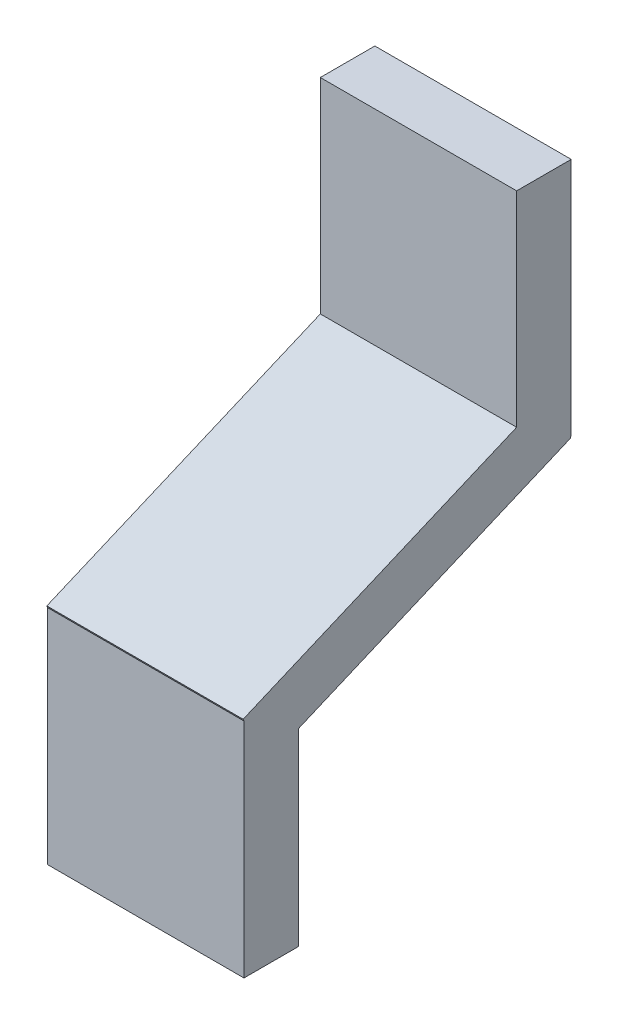
ISO-10303-21;
HEADER;
FILE_DESCRIPTION(('STEP AP214'),'2;1');
FILE_NAME('part.step','',(''),(''),'','','');
FILE_SCHEMA(('AUTOMOTIVE_DESIGN { 1 0 10303 214 1 1 1 1 }'));
ENDSEC;
DATA;
#1=APPLICATION_CONTEXT('core data for automotive mechanical design processes');
#2=APPLICATION_PROTOCOL_DEFINITION('international standard','automotive_design',2000,#1);
#3=PRODUCT_CONTEXT('',#1,'mechanical');
#4=PRODUCT('Part','Part','',(#3));
#5=PRODUCT_RELATED_PRODUCT_CATEGORY('part','',(#4));
#6=PRODUCT_DEFINITION_FORMATION('','',#4);
#7=PRODUCT_DEFINITION_CONTEXT('part definition',#1,'design');
#8=PRODUCT_DEFINITION('design','',#6,#7);
#9=PRODUCT_DEFINITION_SHAPE('','',#8);
#10=(LENGTH_UNIT() NAMED_UNIT(*) SI_UNIT(.MILLI.,.METRE.));
#11=(NAMED_UNIT(*) PLANE_ANGLE_UNIT() SI_UNIT($,.RADIAN.));
#12=(NAMED_UNIT(*) SI_UNIT($,.STERADIAN.) SOLID_ANGLE_UNIT());
#13=UNCERTAINTY_MEASURE_WITH_UNIT(LENGTH_MEASURE(1.E-05),#10,'distance_accuracy_value','');
#14=(GEOMETRIC_REPRESENTATION_CONTEXT(3) GLOBAL_UNCERTAINTY_ASSIGNED_CONTEXT((#13)) GLOBAL_UNIT_ASSIGNED_CONTEXT((#10,
#11,#12)) REPRESENTATION_CONTEXT('',''));
#15=CARTESIAN_POINT('',(0.,0.,0.));
#16=DIRECTION('',(0.,0.,1.));
#17=DIRECTION('',(1.,0.,0.));
#18=AXIS2_PLACEMENT_3D('',#15,#16,#17);
#19=CARTESIAN_POINT('',(5.02,11.,0.5));
#20=DIRECTION('',(0.,0.,1.));
#21=DIRECTION('',(1.,0.,0.));
#22=AXIS2_PLACEMENT_3D('',#19,#20,#21);
#23=PLANE('',#22);
#24=DIRECTION('',(1.,0.,0.));
#25=VECTOR('',#24,1.);
#26=CARTESIAN_POINT('',(5.02,11.3461054439247,0.500000000000314));
#27=LINE('',#26,#25);
#28=CARTESIAN_POINT('',(5.380000014305,11.3461054439242,0.500000000000105));
#29=VERTEX_POINT('',#28);
#30=CARTESIAN_POINT('',(5.02,11.3461054439243,0.500000000000105));
#31=VERTEX_POINT('',#30);
#32=EDGE_CURVE('E148',#29,#31,#27,.F.);
#33=ORIENTED_EDGE('',*,*,#32,.F.);
#34=DIRECTION('',(0.,1.,0.));
#35=VECTOR('',#34,1.);
#36=CARTESIAN_POINT('',(5.380000014305,11.65,0.5));
#37=LINE('',#36,#35);
#38=CARTESIAN_POINT('',(5.380000014305,11.,0.5));
#39=VERTEX_POINT('',#38);
#40=EDGE_CURVE('E154',#39,#29,#37,.T.);
#41=ORIENTED_EDGE('',*,*,#40,.F.);
#42=DIRECTION('',(1.,0.,0.));
#43=VECTOR('',#42,1.);
#44=CARTESIAN_POINT('',(5.02,11.,0.5));
#45=LINE('',#44,#43);
#46=CARTESIAN_POINT('',(5.02,11.,0.5));
#47=VERTEX_POINT('',#46);
#48=EDGE_CURVE('E135',#39,#47,#45,.F.);
#49=ORIENTED_EDGE('',*,*,#48,.T.);
#50=DIRECTION('',(0.,1.,0.));
#51=VECTOR('',#50,1.);
#52=CARTESIAN_POINT('',(5.02,11.65,0.5));
#53=LINE('',#52,#51);
#54=EDGE_CURVE('E182',#47,#31,#53,.T.);
#55=ORIENTED_EDGE('',*,*,#54,.T.);
#56=EDGE_LOOP('',(#33,#41,#49,#55));
#57=FACE_BOUND('',#56,.T.);
#58=ADVANCED_FACE('F17',(#57),#23,.F.);
#59=CARTESIAN_POINT('',(5.02,11.557949520001,0.0009268707435866));
#60=DIRECTION('',(0.,-0.920504786278108,-0.390731286742046));
#61=DIRECTION('',(0.,0.390731286742046,-0.920504786278108));
#62=AXIS2_PLACEMENT_3D('',#59,#60,#61);
#63=PLANE('',#62);
#64=DIRECTION('',(0.,0.39073128674346,-0.920504786277508));
#65=VECTOR('',#64,1.);
#66=CARTESIAN_POINT('',(5.380000014305,11.346105443924,0.5));
#67=LINE('',#66,#65);
#68=CARTESIAN_POINT('',(5.380000014305,11.557949520001,0.000926870743687937));
#69=VERTEX_POINT('',#68);
#70=EDGE_CURVE('E151',#29,#69,#67,.T.);
#71=ORIENTED_EDGE('',*,*,#70,.F.);
#72=ORIENTED_EDGE('',*,*,#32,.T.);
#73=DIRECTION('',(0.,0.39073128674346,-0.920504786277508));
#74=VECTOR('',#73,1.);
#75=CARTESIAN_POINT('',(5.02,11.346105443924,0.5));
#76=LINE('',#75,#74);
#77=CARTESIAN_POINT('',(5.02,11.557949520001,0.000926870743697301));
#78=VERTEX_POINT('',#77);
#79=EDGE_CURVE('E178',#31,#78,#76,.T.);
#80=ORIENTED_EDGE('',*,*,#79,.T.);
#81=DIRECTION('',(1.,0.,0.));
#82=VECTOR('',#81,1.);
#83=CARTESIAN_POINT('',(5.02,11.557949520001,0.00092687074374427));
#84=LINE('',#83,#82);
#85=EDGE_CURVE('E145',#78,#69,#84,.T.);
#86=ORIENTED_EDGE('',*,*,#85,.T.);
#87=EDGE_LOOP('',(#71,#72,#80,#86));
#88=FACE_BOUND('',#87,.T.);
#89=ADVANCED_FACE('F242',(#88),#63,.T.);
#90=CARTESIAN_POINT('',(5.02,11.65,0.04));
#91=DIRECTION('',(0.,-0.390731286742046,0.920504786278108));
#92=DIRECTION('',(0.,-0.920504786278108,-0.390731286742046));
#93=AXIS2_PLACEMENT_3D('',#90,#91,#92);
#94=PLANE('',#93);
#95=DIRECTION('',(0.,0.920504786259214,0.390731286786557));
#96=VECTOR('',#95,1.);
#97=CARTESIAN_POINT('',(5.02,11.557949520001,0.000926870743659899));
#98=LINE('',#97,#96);
#99=CARTESIAN_POINT('',(5.02,11.56,0.001797248280528));
#100=VERTEX_POINT('',#99);
#101=EDGE_CURVE('E123',#78,#100,#98,.T.);
#102=ORIENTED_EDGE('',*,*,#101,.T.);
#103=DIRECTION('',(1.,0.,0.));
#104=VECTOR('',#103,1.);
#105=CARTESIAN_POINT('',(5.02,11.56,0.001797248280528));
#106=LINE('',#105,#104);
#107=CARTESIAN_POINT('',(5.380000014305,11.56,0.001797248280528));
#108=VERTEX_POINT('',#107);
#109=EDGE_CURVE('E97',#100,#108,#106,.T.);
#110=ORIENTED_EDGE('',*,*,#109,.T.);
#111=DIRECTION('',(0.,0.920504786259214,0.390731286786557));
#112=VECTOR('',#111,1.);
#113=CARTESIAN_POINT('',(5.380000014305,11.557949520001,0.000926870743659899));
#114=LINE('',#113,#112);
#115=EDGE_CURVE('E153',#69,#108,#114,.T.);
#116=ORIENTED_EDGE('',*,*,#115,.F.);
#117=ORIENTED_EDGE('',*,*,#85,.F.);
#118=EDGE_LOOP('',(#102,#110,#116,#117));
#119=FACE_BOUND('',#118,.T.);
#120=ADVANCED_FACE('F243',(#119),#94,.F.);
#121=CARTESIAN_POINT('',(5.02,11.56,0.));
#122=DIRECTION('',(0.,1.,0.));
#123=DIRECTION('',(0.,0.,1.));
#124=AXIS2_PLACEMENT_3D('',#121,#122,#123);
#125=PLANE('',#124);
#126=ORIENTED_EDGE('',*,*,#109,.F.);
#127=DIRECTION('',(0.,0.,1.));
#128=VECTOR('',#127,1.);
#129=CARTESIAN_POINT('',(5.02,11.56,0.));
#130=LINE('',#129,#128);
#131=CARTESIAN_POINT('',(5.02,11.56,0.));
#132=VERTEX_POINT('',#131);
#133=EDGE_CURVE('E20',#100,#132,#130,.F.);
#134=ORIENTED_EDGE('',*,*,#133,.T.);
#135=DIRECTION('',(1.,0.,0.));
#136=VECTOR('',#135,1.);
#137=CARTESIAN_POINT('',(5.02,11.56,0.));
#138=LINE('',#137,#136);
#139=CARTESIAN_POINT('',(5.380000014305,11.56,0.));
#140=VERTEX_POINT('',#139);
#141=EDGE_CURVE('E104',#132,#140,#138,.T.);
#142=ORIENTED_EDGE('',*,*,#141,.T.);
#143=DIRECTION('',(0.,0.,-1.));
#144=VECTOR('',#143,1.);
#145=CARTESIAN_POINT('',(5.380000014305,11.56,0.04));
#146=LINE('',#145,#144);
#147=EDGE_CURVE('E194',#108,#140,#146,.T.);
#148=ORIENTED_EDGE('',*,*,#147,.F.);
#149=EDGE_LOOP('',(#126,#134,#142,#148));
#150=FACE_BOUND('',#149,.T.);
#151=ADVANCED_FACE('F122',(#150),#125,.F.);
#152=CARTESIAN_POINT('',(5.02,11.56,0.));
#153=DIRECTION('',(0.,0.,1.));
#154=DIRECTION('',(1.,0.,0.));
#155=AXIS2_PLACEMENT_3D('',#152,#153,#154);
#156=PLANE('',#155);
#157=ORIENTED_EDGE('',*,*,#141,.F.);
#158=DIRECTION('',(0.,1.,0.));
#159=VECTOR('',#158,1.);
#160=CARTESIAN_POINT('',(5.02,11.65,0.));
#161=LINE('',#160,#159);
#162=CARTESIAN_POINT('',(5.02,11.999999997616,0.));
#163=VERTEX_POINT('',#162);
#164=EDGE_CURVE('E108',#132,#163,#161,.T.);
#165=ORIENTED_EDGE('',*,*,#164,.T.);
#166=DIRECTION('',(1.,0.,0.));
#167=VECTOR('',#166,1.);
#168=CARTESIAN_POINT('',(5.02,11.999999997616,0.));
#169=LINE('',#168,#167);
#170=CARTESIAN_POINT('',(5.380000014305,11.999999997616,0.));
#171=VERTEX_POINT('',#170);
#172=EDGE_CURVE('E110',#171,#163,#169,.F.);
#173=ORIENTED_EDGE('',*,*,#172,.F.);
#174=DIRECTION('',(0.,1.,0.));
#175=VECTOR('',#174,1.);
#176=CARTESIAN_POINT('',(5.380000014305,11.65,0.));
#177=LINE('',#176,#175);
#178=EDGE_CURVE('E109',#140,#171,#177,.T.);
#179=ORIENTED_EDGE('',*,*,#178,.F.);
#180=EDGE_LOOP('',(#157,#165,#173,#179));
#181=FACE_BOUND('',#180,.T.);
#182=ADVANCED_FACE('F106',(#181),#156,.F.);
#183=CARTESIAN_POINT('',(5.02,11.999999997616,0.));
#184=DIRECTION('',(0.,1.,0.));
#185=DIRECTION('',(0.,0.,1.));
#186=AXIS2_PLACEMENT_3D('',#183,#184,#185);
#187=PLANE('',#186);
#188=ORIENTED_EDGE('',*,*,#172,.T.);
#189=DIRECTION('',(0.,0.,-1.));
#190=VECTOR('',#189,1.);
#191=CARTESIAN_POINT('',(5.02,11.999999997616,0.04));
#192=LINE('',#191,#190);
#193=CARTESIAN_POINT('',(5.02,11.999999997616,0.10000000149));
#194=VERTEX_POINT('',#193);
#195=EDGE_CURVE('E120',#163,#194,#192,.F.);
#196=ORIENTED_EDGE('',*,*,#195,.T.);
#197=DIRECTION('',(1.,0.,0.));
#198=VECTOR('',#197,1.);
#199=CARTESIAN_POINT('',(5.02,11.999999997616,0.10000000149));
#200=LINE('',#199,#198);
#201=CARTESIAN_POINT('',(5.380000014305,11.999999997616,0.10000000149));
#202=VERTEX_POINT('',#201);
#203=EDGE_CURVE('E181',#202,#194,#200,.F.);
#204=ORIENTED_EDGE('',*,*,#203,.F.);
#205=DIRECTION('',(0.,0.,-1.));
#206=VECTOR('',#205,1.);
#207=CARTESIAN_POINT('',(5.380000014305,11.999999997616,0.04));
#208=LINE('',#207,#206);
#209=EDGE_CURVE('E140',#171,#202,#208,.F.);
#210=ORIENTED_EDGE('',*,*,#209,.F.);
#211=EDGE_LOOP('',(#188,#196,#204,#210));
#212=FACE_BOUND('',#211,.T.);
#213=ADVANCED_FACE('F271',(#212),#187,.T.);
#214=CARTESIAN_POINT('',(5.02,11.,0.60000000149));
#215=DIRECTION('',(0.,0.,1.));
#216=DIRECTION('',(1.,0.,0.));
#217=AXIS2_PLACEMENT_3D('',#214,#215,#216);
#218=PLANE('',#217);
#219=DIRECTION('',(0.,1.,0.));
#220=VECTOR('',#219,1.);
#221=CARTESIAN_POINT('',(5.380000014305,11.65,0.60000000149));
#222=LINE('',#221,#220);
#223=CARTESIAN_POINT('',(5.380000014305,11.408101447657,0.600000001490072));
#224=VERTEX_POINT('',#223);
#225=CARTESIAN_POINT('',(5.380000014305,11.,0.60000000149));
#226=VERTEX_POINT('',#225);
#227=EDGE_CURVE('E168',#224,#226,#222,.F.);
#228=ORIENTED_EDGE('',*,*,#227,.F.);
#229=DIRECTION('',(1.,0.,0.));
#230=VECTOR('',#229,1.);
#231=CARTESIAN_POINT('',(5.02,11.4081014476569,0.600000001490144));
#232=LINE('',#231,#230);
#233=CARTESIAN_POINT('',(5.02,11.408101447657,0.600000001490072));
#234=VERTEX_POINT('',#233);
#235=EDGE_CURVE('E124',#234,#224,#232,.T.);
#236=ORIENTED_EDGE('',*,*,#235,.F.);
#237=DIRECTION('',(0.,1.,0.));
#238=VECTOR('',#237,1.);
#239=CARTESIAN_POINT('',(5.02,11.65,0.60000000149));
#240=LINE('',#239,#238);
#241=CARTESIAN_POINT('',(5.02,11.,0.60000000149));
#242=VERTEX_POINT('',#241);
#243=EDGE_CURVE('E192',#234,#242,#240,.F.);
#244=ORIENTED_EDGE('',*,*,#243,.T.);
#245=DIRECTION('',(1.,0.,0.));
#246=VECTOR('',#245,1.);
#247=CARTESIAN_POINT('',(5.02,11.,0.60000000149));
#248=LINE('',#247,#246);
#249=EDGE_CURVE('E127',#242,#226,#248,.T.);
#250=ORIENTED_EDGE('',*,*,#249,.T.);
#251=EDGE_LOOP('',(#228,#236,#244,#250));
#252=FACE_BOUND('',#251,.T.);
#253=ADVANCED_FACE('F232',(#252),#218,.T.);
#254=CARTESIAN_POINT('',(5.02,11.,0.5));
#255=DIRECTION('',(0.,1.,0.));
#256=DIRECTION('',(0.,0.,1.));
#257=AXIS2_PLACEMENT_3D('',#254,#255,#256);
#258=PLANE('',#257);
#259=DIRECTION('',(0.,0.,-1.));
#260=VECTOR('',#259,1.);
#261=CARTESIAN_POINT('',(5.02,11.,0.04));
#262=LINE('',#261,#260);
#263=EDGE_CURVE('E187',#242,#47,#262,.T.);
#264=ORIENTED_EDGE('',*,*,#263,.T.);
#265=ORIENTED_EDGE('',*,*,#48,.F.);
#266=DIRECTION('',(0.,0.,-1.));
#267=VECTOR('',#266,1.);
#268=CARTESIAN_POINT('',(5.380000014305,11.,0.04));
#269=LINE('',#268,#267);
#270=EDGE_CURVE('E164',#226,#39,#269,.T.);
#271=ORIENTED_EDGE('',*,*,#270,.F.);
#272=ORIENTED_EDGE('',*,*,#249,.F.);
#273=EDGE_LOOP('',(#264,#265,#271,#272));
#274=FACE_BOUND('',#273,.T.);
#275=ADVANCED_FACE('F235',(#274),#258,.F.);
#276=CARTESIAN_POINT('',(5.02,11.411653909498,0.601507932798));
#277=DIRECTION('',(0.,-0.390731286742046,0.920504786278108));
#278=DIRECTION('',(0.,-0.920504786278108,-0.390731286742046));
#279=AXIS2_PLACEMENT_3D('',#276,#277,#278);
#280=PLANE('',#279);
#281=ORIENTED_EDGE('',*,*,#235,.T.);
#282=DIRECTION('',(0.,-0.920504786262243,-0.390731286779422));
#283=VECTOR('',#282,1.);
#284=CARTESIAN_POINT('',(5.380000014305,11.411653909498,0.601507932798));
#285=LINE('',#284,#283);
#286=CARTESIAN_POINT('',(5.380000014305,11.4116539094979,0.601507932797974));
#287=VERTEX_POINT('',#286);
#288=EDGE_CURVE('E227',#287,#224,#285,.T.);
#289=ORIENTED_EDGE('',*,*,#288,.F.);
#290=DIRECTION('',(1.,0.,0.));
#291=VECTOR('',#290,1.);
#292=CARTESIAN_POINT('',(5.02,11.4116539094978,0.601507932797897));
#293=LINE('',#292,#291);
#294=CARTESIAN_POINT('',(5.02,11.4116539094979,0.601507932797974));
#295=VERTEX_POINT('',#294);
#296=EDGE_CURVE('E167',#287,#295,#293,.F.);
#297=ORIENTED_EDGE('',*,*,#296,.T.);
#298=DIRECTION('',(0.,-0.920504786262243,-0.390731286779422));
#299=VECTOR('',#298,1.);
#300=CARTESIAN_POINT('',(5.02,11.411653909498,0.601507932798));
#301=LINE('',#300,#299);
#302=EDGE_CURVE('E175',#295,#234,#301,.T.);
#303=ORIENTED_EDGE('',*,*,#302,.T.);
#304=EDGE_LOOP('',(#281,#289,#297,#303));
#305=FACE_BOUND('',#304,.T.);
#306=ADVANCED_FACE('F210',(#305),#280,.T.);
#307=CARTESIAN_POINT('',(5.02,11.65,0.04));
#308=DIRECTION('',(1.,0.,0.));
#309=DIRECTION('',(0.,0.,-1.));
#310=AXIS2_PLACEMENT_3D('',#307,#308,#309);
#311=PLANE('',#310);
#312=ORIENTED_EDGE('',*,*,#54,.F.);
#313=ORIENTED_EDGE('',*,*,#263,.F.);
#314=ORIENTED_EDGE('',*,*,#243,.F.);
#315=ORIENTED_EDGE('',*,*,#302,.F.);
#316=DIRECTION('',(0.,0.390731286742046,-0.920504786278108));
#317=VECTOR('',#316,1.);
#318=CARTESIAN_POINT('',(5.02,11.65,0.04));
#319=LINE('',#318,#317);
#320=CARTESIAN_POINT('',(5.02,11.624531498221,0.100000001490019));
#321=VERTEX_POINT('',#320);
#322=EDGE_CURVE('E216',#295,#321,#319,.T.);
#323=ORIENTED_EDGE('',*,*,#322,.T.);
#324=DIRECTION('',(0.,1.,0.));
#325=VECTOR('',#324,1.);
#326=CARTESIAN_POINT('',(5.02,11.56,0.10000000149));
#327=LINE('',#326,#325);
#328=EDGE_CURVE('E161',#194,#321,#327,.F.);
#329=ORIENTED_EDGE('',*,*,#328,.F.);
#330=ORIENTED_EDGE('',*,*,#195,.F.);
#331=ORIENTED_EDGE('',*,*,#164,.F.);
#332=ORIENTED_EDGE('',*,*,#133,.F.);
#333=ORIENTED_EDGE('',*,*,#101,.F.);
#334=ORIENTED_EDGE('',*,*,#79,.F.);
#335=EDGE_LOOP('',(#312,#313,#314,#315,#323,#329,#330,#331,#332,#333,#334));
#336=FACE_BOUND('',#335,.T.);
#337=ADVANCED_FACE('F115',(#336),#311,.F.);
#338=CARTESIAN_POINT('',(5.02,11.56,0.10000000149));
#339=DIRECTION('',(0.,0.,1.));
#340=DIRECTION('',(1.,0.,0.));
#341=AXIS2_PLACEMENT_3D('',#338,#339,#340);
#342=PLANE('',#341);
#343=ORIENTED_EDGE('',*,*,#328,.T.);
#344=DIRECTION('',(1.,0.,0.));
#345=VECTOR('',#344,1.);
#346=CARTESIAN_POINT('',(5.02,11.6245314982212,0.100000001490075));
#347=LINE('',#346,#345);
#348=CARTESIAN_POINT('',(5.380000014305,11.624531498221,0.100000001490019));
#349=VERTEX_POINT('',#348);
#350=EDGE_CURVE('E26',#321,#349,#347,.T.);
#351=ORIENTED_EDGE('',*,*,#350,.T.);
#352=DIRECTION('',(0.,1.,0.));
#353=VECTOR('',#352,1.);
#354=CARTESIAN_POINT('',(5.380000014305,11.65,0.10000000149));
#355=LINE('',#354,#353);
#356=EDGE_CURVE('E34',#202,#349,#355,.F.);
#357=ORIENTED_EDGE('',*,*,#356,.F.);
#358=ORIENTED_EDGE('',*,*,#203,.T.);
#359=EDGE_LOOP('',(#343,#351,#357,#358));
#360=FACE_BOUND('',#359,.T.);
#361=ADVANCED_FACE('F257',(#360),#342,.T.);
#362=CARTESIAN_POINT('',(5.380000014305,11.65,0.04));
#363=DIRECTION('',(1.,0.,0.));
#364=DIRECTION('',(0.,0.,-1.));
#365=AXIS2_PLACEMENT_3D('',#362,#363,#364);
#366=PLANE('',#365);
#367=ORIENTED_EDGE('',*,*,#227,.T.);
#368=ORIENTED_EDGE('',*,*,#270,.T.);
#369=ORIENTED_EDGE('',*,*,#40,.T.);
#370=ORIENTED_EDGE('',*,*,#70,.T.);
#371=ORIENTED_EDGE('',*,*,#115,.T.);
#372=ORIENTED_EDGE('',*,*,#147,.T.);
#373=ORIENTED_EDGE('',*,*,#178,.T.);
#374=ORIENTED_EDGE('',*,*,#209,.T.);
#375=ORIENTED_EDGE('',*,*,#356,.T.);
#376=DIRECTION('',(0.,0.390731286742046,-0.920504786278108));
#377=VECTOR('',#376,1.);
#378=CARTESIAN_POINT('',(5.380000014305,11.65,0.04));
#379=LINE('',#378,#377);
#380=EDGE_CURVE('E11',#349,#287,#379,.F.);
#381=ORIENTED_EDGE('',*,*,#380,.T.);
#382=ORIENTED_EDGE('',*,*,#288,.T.);
#383=EDGE_LOOP('',(#367,#368,#369,#370,#371,#372,#373,#374,#375,#381,#382));
#384=FACE_BOUND('',#383,.T.);
#385=ADVANCED_FACE('F230',(#384),#366,.T.);
#386=CARTESIAN_POINT('',(5.02,11.65,0.04));
#387=DIRECTION('',(0.,-0.920504786278108,-0.390731286742046));
#388=DIRECTION('',(0.,0.390731286742046,-0.920504786278108));
#389=AXIS2_PLACEMENT_3D('',#386,#387,#388);
#390=PLANE('',#389);
#391=ORIENTED_EDGE('',*,*,#350,.F.);
#392=ORIENTED_EDGE('',*,*,#322,.F.);
#393=ORIENTED_EDGE('',*,*,#296,.F.);
#394=ORIENTED_EDGE('',*,*,#380,.F.);
#395=EDGE_LOOP('',(#391,#392,#393,#394));
#396=FACE_BOUND('',#395,.T.);
#397=ADVANCED_FACE('F220',(#396),#390,.F.);
#398=CLOSED_SHELL('',(#58,#89,#120,#151,#182,#213,#253,#275,#306,#337,#361,#385,#397));
#399=MANIFOLD_SOLID_BREP('B1',#398);
#400=ADVANCED_BREP_SHAPE_REPRESENTATION('',(#18,#399),#14);
#401=SHAPE_DEFINITION_REPRESENTATION(#9,#400);
ENDSEC;
END-ISO-10303-21;
